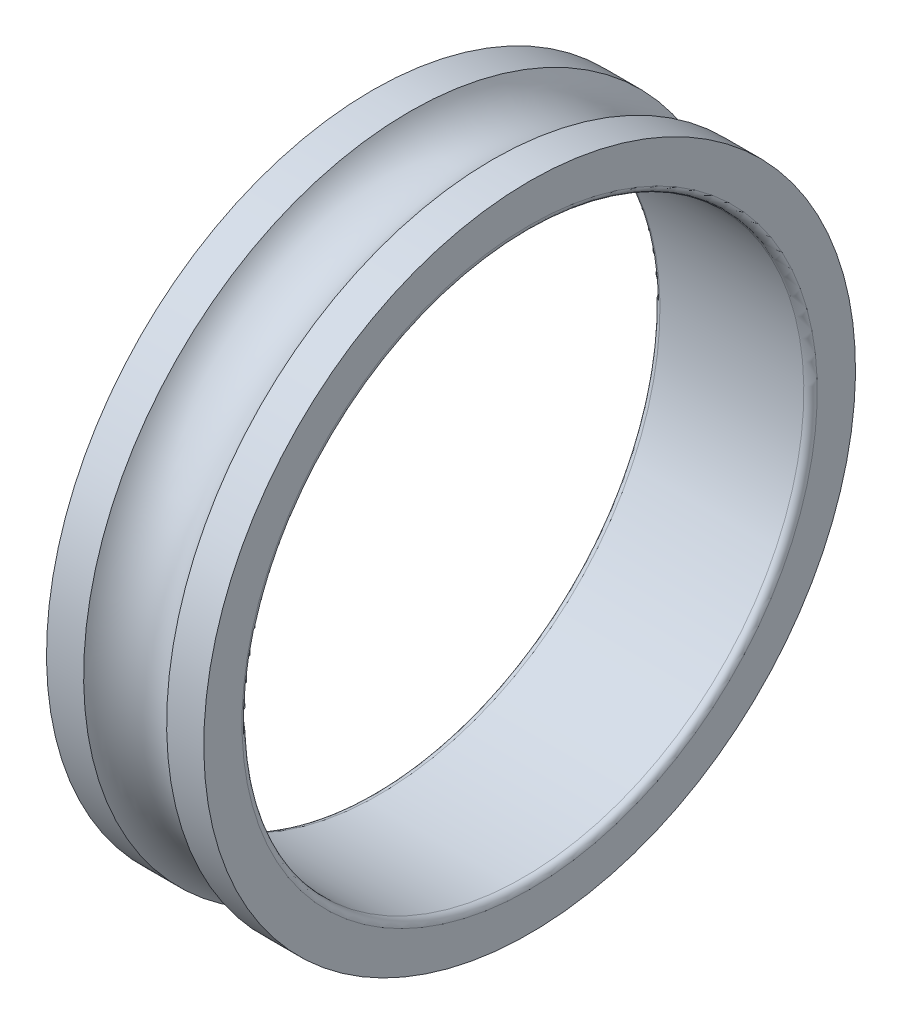
ISO-10303-21;
HEADER;
FILE_DESCRIPTION(('STEP AP214'),'2;1');
FILE_NAME('part.step','',(''),(''),'','','');
FILE_SCHEMA(('AUTOMOTIVE_DESIGN { 1 0 10303 214 1 1 1 1 }'));
ENDSEC;
DATA;
#1=APPLICATION_CONTEXT('core data for automotive mechanical design processes');
#2=APPLICATION_PROTOCOL_DEFINITION('international standard','automotive_design',2000,#1);
#3=PRODUCT_CONTEXT('',#1,'mechanical');
#4=PRODUCT('Part','Part','',(#3));
#5=PRODUCT_RELATED_PRODUCT_CATEGORY('part','',(#4));
#6=PRODUCT_DEFINITION_FORMATION('','',#4);
#7=PRODUCT_DEFINITION_CONTEXT('part definition',#1,'design');
#8=PRODUCT_DEFINITION('design','',#6,#7);
#9=PRODUCT_DEFINITION_SHAPE('','',#8);
#10=(LENGTH_UNIT() NAMED_UNIT(*) SI_UNIT(.MILLI.,.METRE.));
#11=(NAMED_UNIT(*) PLANE_ANGLE_UNIT() SI_UNIT($,.RADIAN.));
#12=(NAMED_UNIT(*) SI_UNIT($,.STERADIAN.) SOLID_ANGLE_UNIT());
#13=UNCERTAINTY_MEASURE_WITH_UNIT(LENGTH_MEASURE(1.E-05),#10,'distance_accuracy_value','');
#14=(GEOMETRIC_REPRESENTATION_CONTEXT(3) GLOBAL_UNCERTAINTY_ASSIGNED_CONTEXT((#13)) GLOBAL_UNIT_ASSIGNED_CONTEXT((#10,
#11,#12)) REPRESENTATION_CONTEXT('',''));
#15=CARTESIAN_POINT('',(0.,0.,0.));
#16=DIRECTION('',(0.,0.,1.));
#17=DIRECTION('',(1.,0.,0.));
#18=AXIS2_PLACEMENT_3D('',#15,#16,#17);
#19=CARTESIAN_POINT('',(-3.2,0.,0.));
#20=DIRECTION('',(1.,0.,0.));
#21=DIRECTION('',(0.,0.,-1.));
#22=AXIS2_PLACEMENT_3D('',#19,#20,#21);
#23=TOROIDAL_SURFACE('',#22,12.8,0.3);
#24=CARTESIAN_POINT('',(-3.2,0.,0.));
#25=DIRECTION('',(1.,0.,0.));
#26=DIRECTION('',(0.,1.,0.));
#27=AXIS2_PLACEMENT_3D('',#24,#25,#26);
#28=CIRCLE('',#27,12.5);
#29=CARTESIAN_POINT('',(-3.2,12.5,0.));
#30=VERTEX_POINT('',#29);
#31=EDGE_CURVE('E11',#30,#30,#28,.T.);
#32=ORIENTED_EDGE('',*,*,#31,.T.);
#33=EDGE_LOOP('',(#32));
#34=FACE_BOUND('',#33,.T.);
#35=CARTESIAN_POINT('',(-3.5,0.,0.));
#36=DIRECTION('',(1.,0.,0.));
#37=DIRECTION('',(0.,1.,0.));
#38=AXIS2_PLACEMENT_3D('',#35,#36,#37);
#39=CIRCLE('',#38,12.8);
#40=CARTESIAN_POINT('',(-3.5,12.8,0.));
#41=VERTEX_POINT('',#40);
#42=EDGE_CURVE('E62',#41,#41,#39,.T.);
#43=ORIENTED_EDGE('',*,*,#42,.F.);
#44=EDGE_LOOP('',(#43));
#45=FACE_BOUND('',#44,.T.);
#46=ADVANCED_FACE('F17',(#34,#45),#23,.T.);
#47=CARTESIAN_POINT('',(0.,0.,0.));
#48=DIRECTION('',(-1.,0.,0.));
#49=DIRECTION('',(0.,1.,0.));
#50=AXIS2_PLACEMENT_3D('',#47,#48,#49);
#51=CYLINDRICAL_SURFACE('',#50,12.5);
#52=CARTESIAN_POINT('',(3.2,0.,0.));
#53=DIRECTION('',(1.,0.,0.));
#54=DIRECTION('',(0.,1.,0.));
#55=AXIS2_PLACEMENT_3D('',#52,#53,#54);
#56=CIRCLE('',#55,12.5);
#57=CARTESIAN_POINT('',(3.2,12.5,0.));
#58=VERTEX_POINT('',#57);
#59=EDGE_CURVE('E27',#58,#58,#56,.T.);
#60=ORIENTED_EDGE('',*,*,#59,.T.);
#61=EDGE_LOOP('',(#60));
#62=FACE_BOUND('',#61,.T.);
#63=ORIENTED_EDGE('',*,*,#31,.F.);
#64=EDGE_LOOP('',(#63));
#65=FACE_BOUND('',#64,.T.);
#66=ADVANCED_FACE('F83',(#62,#65),#51,.F.);
#67=CARTESIAN_POINT('',(3.2,0.,0.));
#68=DIRECTION('',(1.,0.,0.));
#69=DIRECTION('',(0.,0.,-1.));
#70=AXIS2_PLACEMENT_3D('',#67,#68,#69);
#71=TOROIDAL_SURFACE('',#70,12.8,0.3);
#72=CARTESIAN_POINT('',(3.5,0.,0.));
#73=DIRECTION('',(1.,0.,0.));
#74=DIRECTION('',(0.,1.,0.));
#75=AXIS2_PLACEMENT_3D('',#72,#73,#74);
#76=CIRCLE('',#75,12.8);
#77=CARTESIAN_POINT('',(3.5,12.8,0.));
#78=VERTEX_POINT('',#77);
#79=EDGE_CURVE('E60',#78,#78,#76,.T.);
#80=ORIENTED_EDGE('',*,*,#79,.T.);
#81=EDGE_LOOP('',(#80));
#82=FACE_BOUND('',#81,.T.);
#83=ORIENTED_EDGE('',*,*,#59,.F.);
#84=EDGE_LOOP('',(#83));
#85=FACE_BOUND('',#84,.T.);
#86=ADVANCED_FACE('F88',(#82,#85),#71,.T.);
#87=CARTESIAN_POINT('',(3.5,13.65,0.));
#88=DIRECTION('',(1.,0.,0.));
#89=DIRECTION('',(0.,1.,0.));
#90=AXIS2_PLACEMENT_3D('',#87,#88,#89);
#91=PLANE('',#90);
#92=CARTESIAN_POINT('',(3.5,0.,0.));
#93=DIRECTION('',(1.,0.,0.));
#94=DIRECTION('',(0.,1.,0.));
#95=AXIS2_PLACEMENT_3D('',#92,#93,#94);
#96=CIRCLE('',#95,14.5);
#97=CARTESIAN_POINT('',(3.5,14.5,0.));
#98=VERTEX_POINT('',#97);
#99=EDGE_CURVE('E50',#98,#98,#96,.T.);
#100=ORIENTED_EDGE('',*,*,#99,.T.);
#101=EDGE_LOOP('',(#100));
#102=FACE_BOUND('',#101,.T.);
#103=ORIENTED_EDGE('',*,*,#79,.F.);
#104=EDGE_LOOP('',(#103));
#105=FACE_BOUND('',#104,.T.);
#106=ADVANCED_FACE('F94',(#102,#105),#91,.T.);
#107=CARTESIAN_POINT('',(2.67330926563097,0.,0.));
#108=DIRECTION('',(-1.,0.,0.));
#109=DIRECTION('',(0.,1.,0.));
#110=AXIS2_PLACEMENT_3D('',#107,#108,#109);
#111=CYLINDRICAL_SURFACE('',#110,14.5);
#112=CARTESIAN_POINT('',(1.84661853126194,0.,0.));
#113=DIRECTION('',(1.,0.,0.));
#114=DIRECTION('',(0.,1.,0.));
#115=AXIS2_PLACEMENT_3D('',#112,#113,#114);
#116=CIRCLE('',#115,14.5);
#117=CARTESIAN_POINT('',(1.84661853126194,14.5,0.));
#118=VERTEX_POINT('',#117);
#119=EDGE_CURVE('E54',#118,#118,#116,.T.);
#120=ORIENTED_EDGE('',*,*,#119,.T.);
#121=EDGE_LOOP('',(#120));
#122=FACE_BOUND('',#121,.T.);
#123=ORIENTED_EDGE('',*,*,#99,.F.);
#124=EDGE_LOOP('',(#123));
#125=FACE_BOUND('',#124,.T.);
#126=ADVANCED_FACE('F55',(#122,#125),#111,.T.);
#127=CARTESIAN_POINT('',(0.,0.,0.));
#128=DIRECTION('',(1.,0.,0.));
#129=DIRECTION('',(0.,0.,-1.));
#130=AXIS2_PLACEMENT_3D('',#127,#128,#129);
#131=TOROIDAL_SURFACE('',#130,15.5,2.1);
#132=CARTESIAN_POINT('',(-1.84661853126194,0.,0.));
#133=DIRECTION('',(1.,0.,0.));
#134=DIRECTION('',(0.,1.,0.));
#135=AXIS2_PLACEMENT_3D('',#132,#133,#134);
#136=CIRCLE('',#135,14.5);
#137=CARTESIAN_POINT('',(-1.84661853126194,14.5,0.));
#138=VERTEX_POINT('',#137);
#139=EDGE_CURVE('E58',#138,#138,#136,.T.);
#140=ORIENTED_EDGE('',*,*,#139,.T.);
#141=EDGE_LOOP('',(#140));
#142=FACE_BOUND('',#141,.T.);
#143=ORIENTED_EDGE('',*,*,#119,.F.);
#144=EDGE_LOOP('',(#143));
#145=FACE_BOUND('',#144,.T.);
#146=ADVANCED_FACE('F79',(#142,#145),#131,.F.);
#147=CARTESIAN_POINT('',(-2.67330926563097,0.,0.));
#148=DIRECTION('',(-1.,0.,0.));
#149=DIRECTION('',(0.,1.,0.));
#150=AXIS2_PLACEMENT_3D('',#147,#148,#149);
#151=CYLINDRICAL_SURFACE('',#150,14.5);
#152=CARTESIAN_POINT('',(-3.5,0.,0.));
#153=DIRECTION('',(1.,0.,0.));
#154=DIRECTION('',(0.,1.,0.));
#155=AXIS2_PLACEMENT_3D('',#152,#153,#154);
#156=CIRCLE('',#155,14.5);
#157=CARTESIAN_POINT('',(-3.5,14.5,0.));
#158=VERTEX_POINT('',#157);
#159=EDGE_CURVE('E21',#158,#158,#156,.T.);
#160=ORIENTED_EDGE('',*,*,#159,.T.);
#161=EDGE_LOOP('',(#160));
#162=FACE_BOUND('',#161,.T.);
#163=ORIENTED_EDGE('',*,*,#139,.F.);
#164=EDGE_LOOP('',(#163));
#165=FACE_BOUND('',#164,.T.);
#166=ADVANCED_FACE('F19',(#162,#165),#151,.T.);
#167=CARTESIAN_POINT('',(-3.5,13.65,0.));
#168=DIRECTION('',(-1.,0.,0.));
#169=DIRECTION('',(0.,-1.,0.));
#170=AXIS2_PLACEMENT_3D('',#167,#168,#169);
#171=PLANE('',#170);
#172=ORIENTED_EDGE('',*,*,#42,.T.);
#173=EDGE_LOOP('',(#172));
#174=FACE_BOUND('',#173,.T.);
#175=ORIENTED_EDGE('',*,*,#159,.F.);
#176=EDGE_LOOP('',(#175));
#177=FACE_BOUND('',#176,.T.);
#178=ADVANCED_FACE('F72',(#174,#177),#171,.T.);
#179=CLOSED_SHELL('',(#46,#66,#86,#106,#126,#146,#166,#178));
#180=MANIFOLD_SOLID_BREP('B1',#179);
#181=ADVANCED_BREP_SHAPE_REPRESENTATION('',(#18,#180),#14);
#182=SHAPE_DEFINITION_REPRESENTATION(#9,#181);
ENDSEC;
END-ISO-10303-21;
